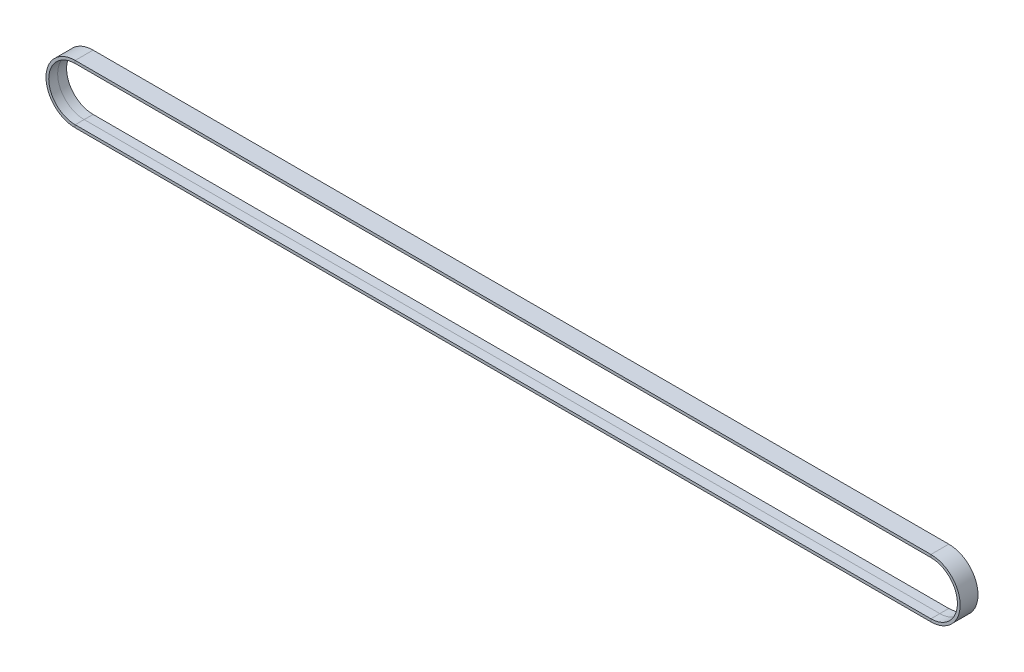
ISO-10303-21;
HEADER;
FILE_DESCRIPTION(('STEP AP214'),'2;1');
FILE_NAME('part.step','',(''),(''),'','','');
FILE_SCHEMA(('AUTOMOTIVE_DESIGN { 1 0 10303 214 1 1 1 1 }'));
ENDSEC;
DATA;
#1=APPLICATION_CONTEXT('core data for automotive mechanical design processes');
#2=APPLICATION_PROTOCOL_DEFINITION('international standard','automotive_design',2000,#1);
#3=PRODUCT_CONTEXT('',#1,'mechanical');
#4=PRODUCT('Part','Part','',(#3));
#5=PRODUCT_RELATED_PRODUCT_CATEGORY('part','',(#4));
#6=PRODUCT_DEFINITION_FORMATION('','',#4);
#7=PRODUCT_DEFINITION_CONTEXT('part definition',#1,'design');
#8=PRODUCT_DEFINITION('design','',#6,#7);
#9=PRODUCT_DEFINITION_SHAPE('','',#8);
#10=(LENGTH_UNIT() NAMED_UNIT(*) SI_UNIT(.MILLI.,.METRE.));
#11=(NAMED_UNIT(*) PLANE_ANGLE_UNIT() SI_UNIT($,.RADIAN.));
#12=(NAMED_UNIT(*) SI_UNIT($,.STERADIAN.) SOLID_ANGLE_UNIT());
#13=UNCERTAINTY_MEASURE_WITH_UNIT(LENGTH_MEASURE(1.E-05),#10,'distance_accuracy_value','');
#14=(GEOMETRIC_REPRESENTATION_CONTEXT(3) GLOBAL_UNCERTAINTY_ASSIGNED_CONTEXT((#13)) GLOBAL_UNIT_ASSIGNED_CONTEXT((#10,
#11,#12)) REPRESENTATION_CONTEXT('',''));
#15=CARTESIAN_POINT('',(0.,0.,0.));
#16=DIRECTION('',(0.,0.,1.));
#17=DIRECTION('',(1.,0.,0.));
#18=AXIS2_PLACEMENT_3D('',#15,#16,#17);
#19=CARTESIAN_POINT('',(-431.000000000001,14.7150000000108,4.5));
#20=DIRECTION('',(0.,0.,1.));
#21=DIRECTION('',(1.,0.,0.));
#22=AXIS2_PLACEMENT_3D('',#19,#20,#21);
#23=PLANE('',#22);
#24=DIRECTION('',(1.,0.,0.));
#25=VECTOR('',#24,1.);
#26=CARTESIAN_POINT('',(-431.000000000001,14.7150000000108,4.5));
#27=LINE('',#26,#25);
#28=CARTESIAN_POINT('',(-431.,14.7150000000108,4.5));
#29=VERTEX_POINT('',#28);
#30=CARTESIAN_POINT('',(-1.69088114503248E-11,14.7150000000108,4.5));
#31=VERTEX_POINT('',#30);
#32=EDGE_CURVE('E11',#29,#31,#27,.T.);
#33=ORIENTED_EDGE('',*,*,#32,.F.);
#34=DIRECTION('',(2.3486646230444E-13,-1.,0.));
#35=VECTOR('',#34,1.);
#36=CARTESIAN_POINT('',(-431.,14.7150000000108,4.5));
#37=LINE('',#36,#35);
#38=CARTESIAN_POINT('',(-431.,13.3450000000089,4.5));
#39=VERTEX_POINT('',#38);
#40=EDGE_CURVE('E39',#29,#39,#37,.T.);
#41=ORIENTED_EDGE('',*,*,#40,.T.);
#42=DIRECTION('',(1.,0.,0.));
#43=VECTOR('',#42,1.);
#44=CARTESIAN_POINT('',(-431.,13.3450000000089,4.5));
#45=LINE('',#44,#43);
#46=CARTESIAN_POINT('',(-1.65870443969673E-11,13.3450000000089,4.5));
#47=VERTEX_POINT('',#46);
#48=EDGE_CURVE('E152',#39,#47,#45,.T.);
#49=ORIENTED_EDGE('',*,*,#48,.T.);
#50=DIRECTION('',(2.3486646230444E-13,-1.,0.));
#51=VECTOR('',#50,1.);
#52=CARTESIAN_POINT('',(-1.69088114503248E-11,14.7150000000108,4.5));
#53=LINE('',#52,#51);
#54=EDGE_CURVE('E155',#31,#47,#53,.T.);
#55=ORIENTED_EDGE('',*,*,#54,.F.);
#56=EDGE_LOOP('',(#33,#41,#49,#55));
#57=FACE_BOUND('',#56,.T.);
#58=ADVANCED_FACE('F36',(#57),#23,.T.);
#59=CARTESIAN_POINT('',(-431.000000000001,14.7150000000108,-4.5));
#60=DIRECTION('',(0.,1.,0.));
#61=DIRECTION('',(0.,0.,1.));
#62=AXIS2_PLACEMENT_3D('',#59,#60,#61);
#63=PLANE('',#62);
#64=DIRECTION('',(1.,0.,0.));
#65=VECTOR('',#64,1.);
#66=CARTESIAN_POINT('',(-431.000000000001,14.7150000000108,-4.5));
#67=LINE('',#66,#65);
#68=CARTESIAN_POINT('',(-431.,14.7150000000108,-4.5));
#69=VERTEX_POINT('',#68);
#70=CARTESIAN_POINT('',(-1.69088114503248E-11,14.7150000000108,-4.5));
#71=VERTEX_POINT('',#70);
#72=EDGE_CURVE('E44',#69,#71,#67,.T.);
#73=ORIENTED_EDGE('',*,*,#72,.F.);
#74=DIRECTION('',(0.,0.,1.));
#75=VECTOR('',#74,1.);
#76=CARTESIAN_POINT('',(-431.,14.7150000000108,-4.5));
#77=LINE('',#76,#75);
#78=EDGE_CURVE('E235',#69,#29,#77,.T.);
#79=ORIENTED_EDGE('',*,*,#78,.T.);
#80=ORIENTED_EDGE('',*,*,#32,.T.);
#81=DIRECTION('',(0.,0.,1.));
#82=VECTOR('',#81,1.);
#83=CARTESIAN_POINT('',(-1.69088114503248E-11,14.7150000000108,-4.5));
#84=LINE('',#83,#82);
#85=EDGE_CURVE('E176',#71,#31,#84,.T.);
#86=ORIENTED_EDGE('',*,*,#85,.F.);
#87=EDGE_LOOP('',(#73,#79,#80,#86));
#88=FACE_BOUND('',#87,.T.);
#89=ADVANCED_FACE('F259',(#88),#63,.T.);
#90=CARTESIAN_POINT('',(-431.,13.3450000000089,-4.5));
#91=DIRECTION('',(0.,0.,-1.));
#92=DIRECTION('',(-1.,0.,0.));
#93=AXIS2_PLACEMENT_3D('',#90,#91,#92);
#94=PLANE('',#93);
#95=DIRECTION('',(1.,0.,0.));
#96=VECTOR('',#95,1.);
#97=CARTESIAN_POINT('',(-431.,13.3450000000089,-4.5));
#98=LINE('',#97,#96);
#99=CARTESIAN_POINT('',(-431.,13.3450000000089,-4.5));
#100=VERTEX_POINT('',#99);
#101=CARTESIAN_POINT('',(-1.62652773436098E-11,13.3450000000089,-4.5));
#102=VERTEX_POINT('',#101);
#103=EDGE_CURVE('E141',#100,#102,#98,.T.);
#104=ORIENTED_EDGE('',*,*,#103,.F.);
#105=DIRECTION('',(-4.69732924608879E-13,1.,0.));
#106=VECTOR('',#105,1.);
#107=CARTESIAN_POINT('',(-431.,13.3450000000089,-4.5));
#108=LINE('',#107,#106);
#109=EDGE_CURVE('E220',#100,#69,#108,.T.);
#110=ORIENTED_EDGE('',*,*,#109,.T.);
#111=ORIENTED_EDGE('',*,*,#72,.T.);
#112=DIRECTION('',(-4.69732924608879E-13,1.,0.));
#113=VECTOR('',#112,1.);
#114=CARTESIAN_POINT('',(-1.62652773436098E-11,13.3450000000089,-4.5));
#115=LINE('',#114,#113);
#116=EDGE_CURVE('E182',#102,#71,#115,.T.);
#117=ORIENTED_EDGE('',*,*,#116,.F.);
#118=EDGE_LOOP('',(#104,#110,#111,#117));
#119=FACE_BOUND('',#118,.T.);
#120=ADVANCED_FACE('F264',(#119),#94,.T.);
#121=CARTESIAN_POINT('',(-431.,13.3450000000119,0.));
#122=DIRECTION('',(0.,-1.,6.66133814775094E-13));
#123=DIRECTION('',(0.,-6.66133814775094E-13,-1.));
#124=AXIS2_PLACEMENT_3D('',#121,#122,#123);
#125=PLANE('',#124);
#126=DIRECTION('',(1.,0.,0.));
#127=VECTOR('',#126,1.);
#128=CARTESIAN_POINT('',(-431.,13.3450000000119,0.));
#129=LINE('',#128,#127);
#130=CARTESIAN_POINT('',(-431.,13.3450000000119,0.));
#131=VERTEX_POINT('',#130);
#132=CARTESIAN_POINT('',(-1.62627271793537E-11,13.3450000000119,0.));
#133=VERTEX_POINT('',#132);
#134=EDGE_CURVE('E148',#131,#133,#129,.T.);
#135=ORIENTED_EDGE('',*,*,#134,.F.);
#136=DIRECTION('',(0.,-6.66133814775094E-13,-1.));
#137=VECTOR('',#136,1.);
#138=CARTESIAN_POINT('',(-431.,13.3450000000119,0.));
#139=LINE('',#138,#137);
#140=EDGE_CURVE('E204',#131,#100,#139,.T.);
#141=ORIENTED_EDGE('',*,*,#140,.T.);
#142=ORIENTED_EDGE('',*,*,#103,.T.);
#143=DIRECTION('',(0.,-6.66133814775094E-13,-1.));
#144=VECTOR('',#143,1.);
#145=CARTESIAN_POINT('',(-1.62627271793537E-11,13.3450000000119,0.));
#146=LINE('',#145,#144);
#147=EDGE_CURVE('E179',#133,#102,#146,.T.);
#148=ORIENTED_EDGE('',*,*,#147,.F.);
#149=EDGE_LOOP('',(#135,#141,#142,#148));
#150=FACE_BOUND('',#149,.T.);
#151=ADVANCED_FACE('F267',(#150),#125,.T.);
#152=CARTESIAN_POINT('',(-430.999999999999,-14.714999999987,4.5));
#153=DIRECTION('',(0.,0.,1.));
#154=DIRECTION('',(1.,0.,0.));
#155=AXIS2_PLACEMENT_3D('',#152,#153,#154);
#156=PLANE('',#155);
#157=ORIENTED_EDGE('',*,*,#40,.F.);
#158=CARTESIAN_POINT('',(-430.999999999999,1.18793863634892E-11,4.5));
#159=DIRECTION('',(0.,0.,-1.));
#160=DIRECTION('',(0.,-1.,0.));
#161=AXIS2_PLACEMENT_3D('',#158,#159,#160);
#162=CIRCLE('',#161,14.7149999999989);
#163=CARTESIAN_POINT('',(-430.999999999999,-14.7150000000108,4.5));
#164=VERTEX_POINT('',#163);
#165=EDGE_CURVE('E81',#164,#29,#162,.T.);
#166=ORIENTED_EDGE('',*,*,#165,.F.);
#167=DIRECTION('',(-2.1837392920003E-13,1.,0.));
#168=VECTOR('',#167,1.);
#169=CARTESIAN_POINT('',(-430.999999999999,-14.714999999987,4.5));
#170=LINE('',#169,#168);
#171=CARTESIAN_POINT('',(-430.999999999999,-13.3450000000089,4.5));
#172=VERTEX_POINT('',#171);
#173=EDGE_CURVE('E207',#164,#172,#170,.T.);
#174=ORIENTED_EDGE('',*,*,#173,.T.);
#175=CARTESIAN_POINT('',(-430.999999999999,1.18793863634892E-11,4.5));
#176=DIRECTION('',(0.,0.,-1.));
#177=DIRECTION('',(0.,-1.,0.));
#178=AXIS2_PLACEMENT_3D('',#175,#176,#177);
#179=CIRCLE('',#178,13.344999999997);
#180=EDGE_CURVE('E201',#172,#39,#179,.T.);
#181=ORIENTED_EDGE('',*,*,#180,.T.);
#182=EDGE_LOOP('',(#157,#166,#174,#181));
#183=FACE_BOUND('',#182,.T.);
#184=ADVANCED_FACE('F248',(#183),#156,.T.);
#185=CARTESIAN_POINT('',(-430.999999999999,1.18793863634892E-11,0.));
#186=DIRECTION('',(0.,0.,-1.));
#187=DIRECTION('',(-1.,0.,0.));
#188=AXIS2_PLACEMENT_3D('',#185,#186,#187);
#189=CYLINDRICAL_SURFACE('',#188,14.7149999999989);
#190=ORIENTED_EDGE('',*,*,#165,.T.);
#191=ORIENTED_EDGE('',*,*,#78,.F.);
#192=CARTESIAN_POINT('',(-430.999999999999,1.18793863634892E-11,-4.5));
#193=DIRECTION('',(0.,0.,-1.));
#194=DIRECTION('',(0.,-1.,0.));
#195=AXIS2_PLACEMENT_3D('',#192,#193,#194);
#196=CIRCLE('',#195,14.7149999999989);
#197=CARTESIAN_POINT('',(-430.999999999999,-14.7150000000108,-4.5));
#198=VERTEX_POINT('',#197);
#199=EDGE_CURVE('E90',#198,#69,#196,.T.);
#200=ORIENTED_EDGE('',*,*,#199,.F.);
#201=DIRECTION('',(0.,0.,1.));
#202=VECTOR('',#201,1.);
#203=CARTESIAN_POINT('',(-430.999999999999,-14.714999999987,-4.5));
#204=LINE('',#203,#202);
#205=EDGE_CURVE('E231',#198,#164,#204,.T.);
#206=ORIENTED_EDGE('',*,*,#205,.T.);
#207=EDGE_LOOP('',(#190,#191,#200,#206));
#208=FACE_BOUND('',#207,.T.);
#209=ADVANCED_FACE('F258',(#208),#189,.T.);
#210=CARTESIAN_POINT('',(-430.999999999999,-13.3449999999851,-4.5));
#211=DIRECTION('',(0.,0.,-1.));
#212=DIRECTION('',(-1.,0.,0.));
#213=AXIS2_PLACEMENT_3D('',#210,#211,#212);
#214=PLANE('',#213);
#215=ORIENTED_EDGE('',*,*,#199,.T.);
#216=ORIENTED_EDGE('',*,*,#109,.F.);
#217=CARTESIAN_POINT('',(-430.999999999999,1.18793863634892E-11,-4.5));
#218=DIRECTION('',(0.,0.,-1.));
#219=DIRECTION('',(0.,-1.,0.));
#220=AXIS2_PLACEMENT_3D('',#217,#218,#219);
#221=CIRCLE('',#220,13.344999999997);
#222=CARTESIAN_POINT('',(-430.999999999999,-13.3450000000089,-4.5));
#223=VERTEX_POINT('',#222);
#224=EDGE_CURVE('E99',#223,#100,#221,.T.);
#225=ORIENTED_EDGE('',*,*,#224,.F.);
#226=DIRECTION('',(4.5324039150447E-13,-1.,0.));
#227=VECTOR('',#226,1.);
#228=CARTESIAN_POINT('',(-430.999999999999,-13.3449999999851,-4.5));
#229=LINE('',#228,#227);
#230=EDGE_CURVE('E217',#223,#198,#229,.T.);
#231=ORIENTED_EDGE('',*,*,#230,.T.);
#232=EDGE_LOOP('',(#215,#216,#225,#231));
#233=FACE_BOUND('',#232,.T.);
#234=ADVANCED_FACE('F279',(#233),#214,.T.);
#235=CARTESIAN_POINT('',(-430.999999999999,1.18793863634892E-11,0.));
#236=DIRECTION('',(0.,0.,-1.));
#237=DIRECTION('',(-1.,0.,0.));
#238=AXIS2_PLACEMENT_3D('',#235,#236,#237);
#239=CYLINDRICAL_SURFACE('',#238,13.3449999999985);
#240=ORIENTED_EDGE('',*,*,#224,.T.);
#241=ORIENTED_EDGE('',*,*,#140,.F.);
#242=CARTESIAN_POINT('',(-430.999999999999,1.18793863634892E-11,0.));
#243=DIRECTION('',(0.,0.,-1.));
#244=DIRECTION('',(0.,-1.,0.));
#245=AXIS2_PLACEMENT_3D('',#242,#243,#244);
#246=CIRCLE('',#245,13.345);
#247=CARTESIAN_POINT('',(-430.999999999999,-13.3450000000119,0.));
#248=VERTEX_POINT('',#247);
#249=EDGE_CURVE('E200',#248,#131,#246,.T.);
#250=ORIENTED_EDGE('',*,*,#249,.F.);
#251=DIRECTION('',(0.,6.66133814775094E-13,-1.));
#252=VECTOR('',#251,1.);
#253=CARTESIAN_POINT('',(-430.999999999999,-13.3449999999881,0.));
#254=LINE('',#253,#252);
#255=EDGE_CURVE('E194',#248,#223,#254,.T.);
#256=ORIENTED_EDGE('',*,*,#255,.T.);
#257=EDGE_LOOP('',(#240,#241,#250,#256));
#258=FACE_BOUND('',#257,.T.);
#259=ADVANCED_FACE('F270',(#258),#239,.F.);
#260=CARTESIAN_POINT('',(-430.999999999999,1.18793863634892E-11,0.));
#261=DIRECTION('',(0.,0.,-1.));
#262=DIRECTION('',(-1.,0.,0.));
#263=AXIS2_PLACEMENT_3D('',#260,#261,#262);
#264=CYLINDRICAL_SURFACE('',#263,13.3449999999985);
#265=ORIENTED_EDGE('',*,*,#249,.T.);
#266=DIRECTION('',(0.,6.66133814775094E-13,-1.));
#267=VECTOR('',#266,1.);
#268=CARTESIAN_POINT('',(-431.,13.3450000000089,4.5));
#269=LINE('',#268,#267);
#270=EDGE_CURVE('E198',#39,#131,#269,.T.);
#271=ORIENTED_EDGE('',*,*,#270,.F.);
#272=ORIENTED_EDGE('',*,*,#180,.F.);
#273=DIRECTION('',(0.,-6.66133814775093E-13,-1.));
#274=VECTOR('',#273,1.);
#275=CARTESIAN_POINT('',(-430.999999999999,-13.3449999999851,4.5));
#276=LINE('',#275,#274);
#277=EDGE_CURVE('E189',#172,#248,#276,.T.);
#278=ORIENTED_EDGE('',*,*,#277,.T.);
#279=EDGE_LOOP('',(#265,#271,#272,#278));
#280=FACE_BOUND('',#279,.T.);
#281=ADVANCED_FACE('F271',(#280),#264,.F.);
#282=CARTESIAN_POINT('',(1.66661238256933E-11,-14.7150000000108,4.5));
#283=DIRECTION('',(0.,0.,1.));
#284=DIRECTION('',(1.,0.,0.));
#285=AXIS2_PLACEMENT_3D('',#282,#283,#284);
#286=PLANE('',#285);
#287=ORIENTED_EDGE('',*,*,#173,.F.);
#288=DIRECTION('',(-1.,0.,0.));
#289=VECTOR('',#288,1.);
#290=CARTESIAN_POINT('',(1.66661238256933E-11,-14.7150000000108,4.5));
#291=LINE('',#290,#289);
#292=CARTESIAN_POINT('',(1.69174369487967E-11,-14.714999999987,4.5));
#293=VERTEX_POINT('',#292);
#294=EDGE_CURVE('E241',#293,#164,#291,.T.);
#295=ORIENTED_EDGE('',*,*,#294,.F.);
#296=DIRECTION('',(-2.35433016194204E-13,1.,0.));
#297=VECTOR('',#296,1.);
#298=CARTESIAN_POINT('',(1.69171482908127E-11,-14.7150000000108,4.5));
#299=LINE('',#298,#297);
#300=CARTESIAN_POINT('',(1.65945295634533E-11,-13.3449999999851,4.5));
#301=VERTEX_POINT('',#300);
#302=EDGE_CURVE('E197',#293,#301,#299,.T.);
#303=ORIENTED_EDGE('',*,*,#302,.T.);
#304=DIRECTION('',(-1.,0.,0.));
#305=VECTOR('',#304,1.);
#306=CARTESIAN_POINT('',(1.63669515426888E-11,-13.3450000000089,4.5));
#307=LINE('',#306,#305);
#308=EDGE_CURVE('E192',#301,#172,#307,.T.);
#309=ORIENTED_EDGE('',*,*,#308,.T.);
#310=EDGE_LOOP('',(#287,#295,#303,#309));
#311=FACE_BOUND('',#310,.T.);
#312=ADVANCED_FACE('F253',(#311),#286,.T.);
#313=CARTESIAN_POINT('',(1.66661238256933E-11,-14.7150000000108,-4.5));
#314=DIRECTION('',(0.,-1.,0.));
#315=DIRECTION('',(0.,0.,-1.));
#316=AXIS2_PLACEMENT_3D('',#313,#314,#315);
#317=PLANE('',#316);
#318=ORIENTED_EDGE('',*,*,#294,.T.);
#319=ORIENTED_EDGE('',*,*,#205,.F.);
#320=DIRECTION('',(-1.,0.,0.));
#321=VECTOR('',#320,1.);
#322=CARTESIAN_POINT('',(1.66661238256933E-11,-14.7150000000108,-4.5));
#323=LINE('',#322,#321);
#324=CARTESIAN_POINT('',(1.69174369487967E-11,-14.714999999987,-4.5));
#325=VERTEX_POINT('',#324);
#326=EDGE_CURVE('E112',#325,#198,#323,.T.);
#327=ORIENTED_EDGE('',*,*,#326,.F.);
#328=DIRECTION('',(0.,0.,1.));
#329=VECTOR('',#328,1.);
#330=CARTESIAN_POINT('',(1.69171482908127E-11,-14.7150000000108,-4.5));
#331=LINE('',#330,#329);
#332=EDGE_CURVE('E228',#325,#293,#331,.T.);
#333=ORIENTED_EDGE('',*,*,#332,.T.);
#334=EDGE_LOOP('',(#318,#319,#327,#333));
#335=FACE_BOUND('',#334,.T.);
#336=ADVANCED_FACE('F257',(#335),#317,.T.);
#337=CARTESIAN_POINT('',(1.60451844893313E-11,-13.3450000000089,-4.5));
#338=DIRECTION('',(0.,0.,-1.));
#339=DIRECTION('',(-1.,0.,0.));
#340=AXIS2_PLACEMENT_3D('',#337,#338,#339);
#341=PLANE('',#340);
#342=ORIENTED_EDGE('',*,*,#326,.T.);
#343=ORIENTED_EDGE('',*,*,#230,.F.);
#344=DIRECTION('',(-1.,0.,0.));
#345=VECTOR('',#344,1.);
#346=CARTESIAN_POINT('',(1.60451844893313E-11,-13.3450000000089,-4.5));
#347=LINE('',#346,#345);
#348=CARTESIAN_POINT('',(1.62727625100958E-11,-13.3449999999851,-4.5));
#349=VERTEX_POINT('',#348);
#350=EDGE_CURVE('E119',#349,#223,#347,.T.);
#351=ORIENTED_EDGE('',*,*,#350,.F.);
#352=DIRECTION('',(4.70299478498644E-13,-1.,0.));
#353=VECTOR('',#352,1.);
#354=CARTESIAN_POINT('',(1.62728380052687E-11,-13.3450000000089,-4.5));
#355=LINE('',#354,#353);
#356=EDGE_CURVE('E213',#349,#325,#355,.T.);
#357=ORIENTED_EDGE('',*,*,#356,.T.);
#358=EDGE_LOOP('',(#342,#343,#351,#357));
#359=FACE_BOUND('',#358,.T.);
#360=ADVANCED_FACE('F308',(#359),#341,.T.);
#361=CARTESIAN_POINT('',(1.60426343250751E-11,-13.3450000000119,0.));
#362=DIRECTION('',(0.,1.,6.66133814775094E-13));
#363=DIRECTION('',(0.,-6.66133814775094E-13,1.));
#364=AXIS2_PLACEMENT_3D('',#361,#362,#363);
#365=PLANE('',#364);
#366=ORIENTED_EDGE('',*,*,#350,.T.);
#367=ORIENTED_EDGE('',*,*,#255,.F.);
#368=DIRECTION('',(-1.,0.,0.));
#369=VECTOR('',#368,1.);
#370=CARTESIAN_POINT('',(1.60426343250751E-11,-13.3450000000119,0.));
#371=LINE('',#370,#369);
#372=CARTESIAN_POINT('',(1.62702123458469E-11,-13.3449999999881,0.));
#373=VERTEX_POINT('',#372);
#374=EDGE_CURVE('E127',#373,#248,#371,.T.);
#375=ORIENTED_EDGE('',*,*,#374,.F.);
#376=DIRECTION('',(0.,6.66133814775094E-13,-1.));
#377=VECTOR('',#376,1.);
#378=CARTESIAN_POINT('',(1.62702878410126E-11,-13.3450000000119,0.));
#379=LINE('',#378,#377);
#380=EDGE_CURVE('E187',#373,#349,#379,.T.);
#381=ORIENTED_EDGE('',*,*,#380,.T.);
#382=EDGE_LOOP('',(#366,#367,#375,#381));
#383=FACE_BOUND('',#382,.T.);
#384=ADVANCED_FACE('F311',(#383),#365,.T.);
#385=CARTESIAN_POINT('',(1.63669515426888E-11,-13.3450000000089,4.5));
#386=DIRECTION('',(0.,1.,-6.66133814775093E-13));
#387=DIRECTION('',(0.,6.66133814775093E-13,1.));
#388=AXIS2_PLACEMENT_3D('',#385,#386,#387);
#389=PLANE('',#388);
#390=ORIENTED_EDGE('',*,*,#374,.T.);
#391=ORIENTED_EDGE('',*,*,#277,.F.);
#392=ORIENTED_EDGE('',*,*,#308,.F.);
#393=DIRECTION('',(0.,-6.66133814775094E-13,-1.));
#394=VECTOR('',#393,1.);
#395=CARTESIAN_POINT('',(1.65946050586262E-11,-13.3450000000089,4.5));
#396=LINE('',#395,#394);
#397=EDGE_CURVE('E168',#301,#373,#396,.T.);
#398=ORIENTED_EDGE('',*,*,#397,.T.);
#399=EDGE_LOOP('',(#390,#391,#392,#398));
#400=FACE_BOUND('',#399,.T.);
#401=ADVANCED_FACE('F251',(#400),#389,.T.);
#402=CARTESIAN_POINT('',(-1.69088114503248E-11,14.7150000000108,4.5));
#403=DIRECTION('',(0.,0.,1.));
#404=DIRECTION('',(1.,0.,0.));
#405=AXIS2_PLACEMENT_3D('',#402,#403,#404);
#406=PLANE('',#405);
#407=ORIENTED_EDGE('',*,*,#302,.F.);
#408=CARTESIAN_POINT('',(-1.60427227058335E-11,1.18793863634892E-11,4.5));
#409=DIRECTION('',(0.,0.,-1.));
#410=DIRECTION('',(0.,1.,0.));
#411=AXIS2_PLACEMENT_3D('',#408,#409,#410);
#412=CIRCLE('',#411,14.7149999999989);
#413=EDGE_CURVE('E175',#31,#293,#412,.T.);
#414=ORIENTED_EDGE('',*,*,#413,.F.);
#415=ORIENTED_EDGE('',*,*,#54,.T.);
#416=CARTESIAN_POINT('',(-1.60427227058335E-11,1.18793863634892E-11,4.5));
#417=DIRECTION('',(0.,0.,-1.));
#418=DIRECTION('',(0.,1.,0.));
#419=AXIS2_PLACEMENT_3D('',#416,#417,#418);
#420=CIRCLE('',#419,13.344999999997);
#421=EDGE_CURVE('E163',#47,#301,#420,.T.);
#422=ORIENTED_EDGE('',*,*,#421,.T.);
#423=EDGE_LOOP('',(#407,#414,#415,#422));
#424=FACE_BOUND('',#423,.T.);
#425=ADVANCED_FACE('F173',(#424),#406,.T.);
#426=CARTESIAN_POINT('',(-1.60427227058335E-11,1.18793863634892E-11,0.));
#427=DIRECTION('',(0.,0.,-1.));
#428=DIRECTION('',(-1.,0.,0.));
#429=AXIS2_PLACEMENT_3D('',#426,#427,#428);
#430=CYLINDRICAL_SURFACE('',#429,14.7149999999989);
#431=ORIENTED_EDGE('',*,*,#413,.T.);
#432=ORIENTED_EDGE('',*,*,#332,.F.);
#433=CARTESIAN_POINT('',(-1.60427227058335E-11,1.18793863634892E-11,-4.5));
#434=DIRECTION('',(0.,0.,-1.));
#435=DIRECTION('',(0.,1.,0.));
#436=AXIS2_PLACEMENT_3D('',#433,#434,#435);
#437=CIRCLE('',#436,14.7149999999989);
#438=EDGE_CURVE('E225',#71,#325,#437,.T.);
#439=ORIENTED_EDGE('',*,*,#438,.F.);
#440=ORIENTED_EDGE('',*,*,#85,.T.);
#441=EDGE_LOOP('',(#431,#432,#439,#440));
#442=FACE_BOUND('',#441,.T.);
#443=ADVANCED_FACE('F255',(#442),#430,.T.);
#444=CARTESIAN_POINT('',(-1.62652773436098E-11,13.3450000000089,-4.5));
#445=DIRECTION('',(0.,0.,-1.));
#446=DIRECTION('',(-1.,0.,0.));
#447=AXIS2_PLACEMENT_3D('',#444,#445,#446);
#448=PLANE('',#447);
#449=ORIENTED_EDGE('',*,*,#438,.T.);
#450=ORIENTED_EDGE('',*,*,#356,.F.);
#451=CARTESIAN_POINT('',(-1.60427227058335E-11,1.18793863634892E-11,-4.5));
#452=DIRECTION('',(0.,0.,-1.));
#453=DIRECTION('',(0.,1.,0.));
#454=AXIS2_PLACEMENT_3D('',#451,#452,#453);
#455=CIRCLE('',#454,13.344999999997);
#456=EDGE_CURVE('E210',#102,#349,#455,.T.);
#457=ORIENTED_EDGE('',*,*,#456,.F.);
#458=ORIENTED_EDGE('',*,*,#116,.T.);
#459=EDGE_LOOP('',(#449,#450,#457,#458));
#460=FACE_BOUND('',#459,.T.);
#461=ADVANCED_FACE('F262',(#460),#448,.T.);
#462=CARTESIAN_POINT('',(-1.60427227058335E-11,1.18793863634892E-11,0.));
#463=DIRECTION('',(0.,0.,-1.));
#464=DIRECTION('',(-1.,0.,0.));
#465=AXIS2_PLACEMENT_3D('',#462,#463,#464);
#466=CYLINDRICAL_SURFACE('',#465,13.3449999999985);
#467=ORIENTED_EDGE('',*,*,#456,.T.);
#468=ORIENTED_EDGE('',*,*,#380,.F.);
#469=CARTESIAN_POINT('',(-1.60427227058335E-11,1.18793863634892E-11,0.));
#470=DIRECTION('',(0.,0.,-1.));
#471=DIRECTION('',(0.,1.,0.));
#472=AXIS2_PLACEMENT_3D('',#469,#470,#471);
#473=CIRCLE('',#472,13.345);
#474=EDGE_CURVE('E186',#133,#373,#473,.T.);
#475=ORIENTED_EDGE('',*,*,#474,.F.);
#476=ORIENTED_EDGE('',*,*,#147,.T.);
#477=EDGE_LOOP('',(#467,#468,#475,#476));
#478=FACE_BOUND('',#477,.T.);
#479=ADVANCED_FACE('F266',(#478),#466,.F.);
#480=CARTESIAN_POINT('',(-1.60427227058335E-11,1.18793863634892E-11,0.));
#481=DIRECTION('',(0.,0.,-1.));
#482=DIRECTION('',(-1.,0.,0.));
#483=AXIS2_PLACEMENT_3D('',#480,#481,#482);
#484=CYLINDRICAL_SURFACE('',#483,13.3449999999985);
#485=ORIENTED_EDGE('',*,*,#474,.T.);
#486=ORIENTED_EDGE('',*,*,#397,.F.);
#487=ORIENTED_EDGE('',*,*,#421,.F.);
#488=DIRECTION('',(0.,6.66133814775094E-13,-1.));
#489=VECTOR('',#488,1.);
#490=CARTESIAN_POINT('',(-1.65870443969673E-11,13.3450000000089,4.5));
#491=LINE('',#490,#489);
#492=EDGE_CURVE('E166',#47,#133,#491,.T.);
#493=ORIENTED_EDGE('',*,*,#492,.T.);
#494=EDGE_LOOP('',(#485,#486,#487,#493));
#495=FACE_BOUND('',#494,.T.);
#496=ADVANCED_FACE('F165',(#495),#484,.F.);
#497=CARTESIAN_POINT('',(-431.,13.3450000000089,4.5));
#498=DIRECTION('',(0.,-1.,-6.66133814775094E-13));
#499=DIRECTION('',(0.,6.66133814775094E-13,-1.));
#500=AXIS2_PLACEMENT_3D('',#497,#498,#499);
#501=PLANE('',#500);
#502=ORIENTED_EDGE('',*,*,#270,.T.);
#503=ORIENTED_EDGE('',*,*,#134,.T.);
#504=ORIENTED_EDGE('',*,*,#492,.F.);
#505=ORIENTED_EDGE('',*,*,#48,.F.);
#506=EDGE_LOOP('',(#502,#503,#504,#505));
#507=FACE_BOUND('',#506,.T.);
#508=ADVANCED_FACE('F178',(#507),#501,.T.);
#509=CLOSED_SHELL('',(#58,#89,#120,#151,#184,#209,#234,#259,#281,#312,#336,#360,#384,#401,#425,
#443,#461,#479,#496,#508));
#510=MANIFOLD_SOLID_BREP('B2',#509);
#511=ADVANCED_BREP_SHAPE_REPRESENTATION('',(#18,#510),#14);
#512=SHAPE_DEFINITION_REPRESENTATION(#9,#511);
ENDSEC;
END-ISO-10303-21;
